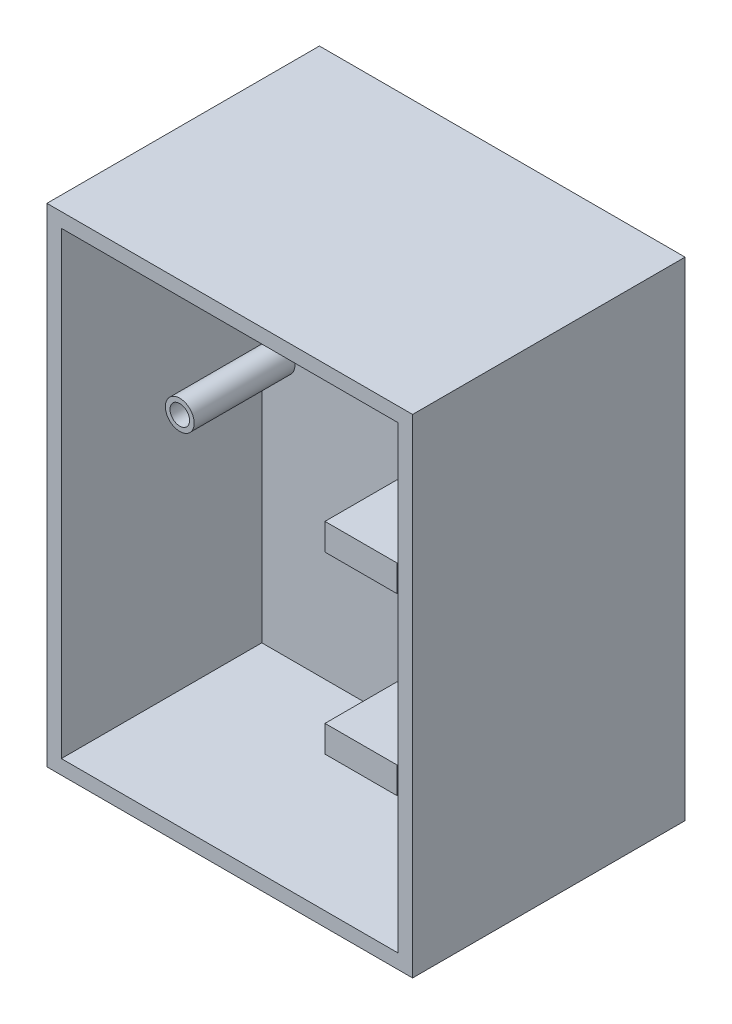
ISO-10303-21;
HEADER;
FILE_DESCRIPTION(('STEP AP214'),'2;1');
FILE_NAME('part.step','',(''),(''),'','','');
FILE_SCHEMA(('AUTOMOTIVE_DESIGN { 1 0 10303 214 1 1 1 1 }'));
ENDSEC;
DATA;
#1=APPLICATION_CONTEXT('core data for automotive mechanical design processes');
#2=APPLICATION_PROTOCOL_DEFINITION('international standard','automotive_design',2000,#1);
#3=PRODUCT_CONTEXT('',#1,'mechanical');
#4=PRODUCT('Part','Part','',(#3));
#5=PRODUCT_RELATED_PRODUCT_CATEGORY('part','',(#4));
#6=PRODUCT_DEFINITION_FORMATION('','',#4);
#7=PRODUCT_DEFINITION_CONTEXT('part definition',#1,'design');
#8=PRODUCT_DEFINITION('design','',#6,#7);
#9=PRODUCT_DEFINITION_SHAPE('','',#8);
#10=(LENGTH_UNIT() NAMED_UNIT(*) SI_UNIT(.MILLI.,.METRE.));
#11=(NAMED_UNIT(*) PLANE_ANGLE_UNIT() SI_UNIT($,.RADIAN.));
#12=(NAMED_UNIT(*) SI_UNIT($,.STERADIAN.) SOLID_ANGLE_UNIT());
#13=UNCERTAINTY_MEASURE_WITH_UNIT(LENGTH_MEASURE(1.E-05),#10,'distance_accuracy_value','');
#14=(GEOMETRIC_REPRESENTATION_CONTEXT(3) GLOBAL_UNCERTAINTY_ASSIGNED_CONTEXT((#13)) GLOBAL_UNIT_ASSIGNED_CONTEXT((#10,
#11,#12)) REPRESENTATION_CONTEXT('',''));
#15=CARTESIAN_POINT('',(0.,0.,0.));
#16=DIRECTION('',(0.,0.,1.));
#17=DIRECTION('',(1.,0.,0.));
#18=AXIS2_PLACEMENT_3D('',#15,#16,#17);
#19=CARTESIAN_POINT('',(0.,0.,0.));
#20=DIRECTION('',(0.,0.,-1.));
#21=DIRECTION('',(-1.,0.,0.));
#22=AXIS2_PLACEMENT_3D('',#19,#20,#21);
#23=PLANE('',#22);
#24=CARTESIAN_POINT('',(-26.3939522457264,35.6308833834333,0.));
#25=DIRECTION('',(0.,0.,-1.));
#26=DIRECTION('',(-1.,0.,0.));
#27=AXIS2_PLACEMENT_3D('',#24,#25,#26);
#28=CIRCLE('',#27,2.54);
#29=CARTESIAN_POINT('',(-28.9339522457264,35.6308833834333,0.));
#30=VERTEX_POINT('',#29);
#31=EDGE_CURVE('E12',#30,#30,#28,.F.);
#32=ORIENTED_EDGE('',*,*,#31,.F.);
#33=EDGE_LOOP('',(#32));
#34=FACE_BOUND('',#33,.T.);
#35=CARTESIAN_POINT('',(26.3939522457264,20.25015,0.));
#36=DIRECTION('',(0.,0.,-1.));
#37=DIRECTION('',(-1.,0.,0.));
#38=AXIS2_PLACEMENT_3D('',#35,#36,#37);
#39=CIRCLE('',#38,2.54);
#40=CARTESIAN_POINT('',(23.8539522457264,20.25015,0.));
#41=VERTEX_POINT('',#40);
#42=EDGE_CURVE('E83',#41,#41,#39,.F.);
#43=ORIENTED_EDGE('',*,*,#42,.F.);
#44=EDGE_LOOP('',(#43));
#45=FACE_BOUND('',#44,.T.);
#46=CARTESIAN_POINT('',(26.3939522457264,6.33839091862332,0.));
#47=DIRECTION('',(0.,0.,-1.));
#48=DIRECTION('',(-1.,0.,0.));
#49=AXIS2_PLACEMENT_3D('',#46,#47,#48);
#50=CIRCLE('',#49,2.54);
#51=CARTESIAN_POINT('',(23.8539522457264,6.33839091862332,0.));
#52=VERTEX_POINT('',#51);
#53=EDGE_CURVE('E364',#52,#52,#50,.F.);
#54=ORIENTED_EDGE('',*,*,#53,.F.);
#55=EDGE_LOOP('',(#54));
#56=FACE_BOUND('',#55,.T.);
#57=CARTESIAN_POINT('',(-26.3939522457264,4.86941661656667,0.));
#58=DIRECTION('',(0.,0.,-1.));
#59=DIRECTION('',(-1.,0.,0.));
#60=AXIS2_PLACEMENT_3D('',#57,#58,#59);
#61=CIRCLE('',#60,2.54);
#62=CARTESIAN_POINT('',(-28.9339522457264,4.86941661656667,0.));
#63=VERTEX_POINT('',#62);
#64=EDGE_CURVE('E361',#63,#63,#61,.F.);
#65=ORIENTED_EDGE('',*,*,#64,.F.);
#66=EDGE_LOOP('',(#65));
#67=FACE_BOUND('',#66,.T.);
#68=DIRECTION('',(0.,-1.,0.));
#69=VECTOR('',#68,1.);
#70=CARTESIAN_POINT('',(-5.86370800542826,0.,0.));
#71=LINE('',#70,#69);
#72=CARTESIAN_POINT('',(-5.86370800542823,-34.5313,0.));
#73=VERTEX_POINT('',#72);
#74=CARTESIAN_POINT('',(-5.86370800542823,-39.2237089373718,0.));
#75=VERTEX_POINT('',#74);
#76=EDGE_CURVE('E259',#73,#75,#71,.T.);
#77=ORIENTED_EDGE('',*,*,#76,.F.);
#78=DIRECTION('',(1.,0.,0.));
#79=VECTOR('',#78,1.);
#80=CARTESIAN_POINT('',(0.,-34.5313,0.));
#81=LINE('',#80,#79);
#82=CARTESIAN_POINT('',(6.83629199457176,-34.5313,0.));
#83=VERTEX_POINT('',#82);
#84=EDGE_CURVE('E243',#73,#83,#81,.T.);
#85=ORIENTED_EDGE('',*,*,#84,.T.);
#86=DIRECTION('',(0.,-1.,0.));
#87=VECTOR('',#86,1.);
#88=CARTESIAN_POINT('',(6.83629199457177,0.,0.));
#89=LINE('',#88,#87);
#90=CARTESIAN_POINT('',(6.83629199457176,-39.2237089373718,0.));
#91=VERTEX_POINT('',#90);
#92=EDGE_CURVE('E248',#83,#91,#89,.T.);
#93=ORIENTED_EDGE('',*,*,#92,.T.);
#94=DIRECTION('',(-1.,0.,0.));
#95=VECTOR('',#94,1.);
#96=CARTESIAN_POINT('',(0.,-39.2237089373718,0.));
#97=LINE('',#96,#95);
#98=EDGE_CURVE('E90',#91,#75,#97,.T.);
#99=ORIENTED_EDGE('',*,*,#98,.T.);
#100=EDGE_LOOP('',(#77,#85,#93,#99));
#101=FACE_BOUND('',#100,.T.);
#102=DIRECTION('',(1.,0.,0.));
#103=VECTOR('',#102,1.);
#104=CARTESIAN_POINT('',(-29.7053,-40.5003,0.));
#105=LINE('',#104,#103);
#106=CARTESIAN_POINT('',(-29.7053,-40.5003,0.));
#107=VERTEX_POINT('',#106);
#108=CARTESIAN_POINT('',(29.7053,-40.5003,0.));
#109=VERTEX_POINT('',#108);
#110=EDGE_CURVE('E318',#107,#109,#105,.T.);
#111=ORIENTED_EDGE('',*,*,#110,.T.);
#112=DIRECTION('',(0.,1.,0.));
#113=VECTOR('',#112,1.);
#114=CARTESIAN_POINT('',(29.7053,40.5003,0.));
#115=LINE('',#114,#113);
#116=CARTESIAN_POINT('',(29.7053,40.5003,0.));
#117=VERTEX_POINT('',#116);
#118=EDGE_CURVE('E314',#109,#117,#115,.T.);
#119=ORIENTED_EDGE('',*,*,#118,.T.);
#120=DIRECTION('',(-1.,0.,0.));
#121=VECTOR('',#120,1.);
#122=CARTESIAN_POINT('',(-29.7053,40.5003,0.));
#123=LINE('',#122,#121);
#124=CARTESIAN_POINT('',(-29.7053,40.5003,0.));
#125=VERTEX_POINT('',#124);
#126=EDGE_CURVE('E328',#117,#125,#123,.T.);
#127=ORIENTED_EDGE('',*,*,#126,.T.);
#128=DIRECTION('',(0.,-1.,0.));
#129=VECTOR('',#128,1.);
#130=CARTESIAN_POINT('',(-29.7053,40.5003,0.));
#131=LINE('',#130,#129);
#132=EDGE_CURVE('E331',#125,#107,#131,.T.);
#133=ORIENTED_EDGE('',*,*,#132,.T.);
#134=EDGE_LOOP('',(#111,#119,#127,#133));
#135=FACE_BOUND('',#134,.T.);
#136=DIRECTION('',(0.,1.,0.));
#137=VECTOR('',#136,1.);
#138=CARTESIAN_POINT('',(6.83629199457176,0.,0.));
#139=LINE('',#138,#137);
#140=CARTESIAN_POINT('',(6.83629199457176,-8.3693,0.));
#141=VERTEX_POINT('',#140);
#142=CARTESIAN_POINT('',(6.83629199457176,-3.67689106262814,0.));
#143=VERTEX_POINT('',#142);
#144=EDGE_CURVE('E272',#141,#143,#139,.T.);
#145=ORIENTED_EDGE('',*,*,#144,.F.);
#146=DIRECTION('',(1.,0.,0.));
#147=VECTOR('',#146,1.);
#148=CARTESIAN_POINT('',(0.,-8.3693,0.));
#149=LINE('',#148,#147);
#150=CARTESIAN_POINT('',(-5.86370800542824,-8.3693,0.));
#151=VERTEX_POINT('',#150);
#152=EDGE_CURVE('E277',#151,#141,#149,.T.);
#153=ORIENTED_EDGE('',*,*,#152,.F.);
#154=DIRECTION('',(0.,1.,0.));
#155=VECTOR('',#154,1.);
#156=CARTESIAN_POINT('',(-5.86370800542824,0.,0.));
#157=LINE('',#156,#155);
#158=CARTESIAN_POINT('',(-5.86370800542824,-3.67689106262814,0.));
#159=VERTEX_POINT('',#158);
#160=EDGE_CURVE('E288',#151,#159,#157,.T.);
#161=ORIENTED_EDGE('',*,*,#160,.T.);
#162=DIRECTION('',(-1.,0.,0.));
#163=VECTOR('',#162,1.);
#164=CARTESIAN_POINT('',(0.,-3.67689106262814,0.));
#165=LINE('',#164,#163);
#166=EDGE_CURVE('E98',#143,#159,#165,.T.);
#167=ORIENTED_EDGE('',*,*,#166,.F.);
#168=EDGE_LOOP('',(#145,#153,#161,#167));
#169=FACE_BOUND('',#168,.T.);
#170=ADVANCED_FACE('F75',(#34,#45,#56,#67,#101,#135,#169),#23,.F.);
#171=CARTESIAN_POINT('',(0.,0.,35.3568));
#172=DIRECTION('',(0.,0.,1.));
#173=DIRECTION('',(1.,0.,0.));
#174=AXIS2_PLACEMENT_3D('',#171,#172,#173);
#175=PLANE('',#174);
#176=DIRECTION('',(0.,1.,0.));
#177=VECTOR('',#176,1.);
#178=CARTESIAN_POINT('',(32.2453,40.5003,35.3568));
#179=LINE('',#178,#177);
#180=CARTESIAN_POINT('',(32.2453,-43.0403,35.3568));
#181=VERTEX_POINT('',#180);
#182=CARTESIAN_POINT('',(32.2453,43.0403,35.3568));
#183=VERTEX_POINT('',#182);
#184=EDGE_CURVE('E344',#181,#183,#179,.T.);
#185=ORIENTED_EDGE('',*,*,#184,.T.);
#186=DIRECTION('',(-1.,0.,0.));
#187=VECTOR('',#186,1.);
#188=CARTESIAN_POINT('',(-29.7053,43.0403,35.3568));
#189=LINE('',#188,#187);
#190=CARTESIAN_POINT('',(-32.2453,43.0403,35.3568));
#191=VERTEX_POINT('',#190);
#192=EDGE_CURVE('E347',#183,#191,#189,.T.);
#193=ORIENTED_EDGE('',*,*,#192,.T.);
#194=DIRECTION('',(0.,-1.,0.));
#195=VECTOR('',#194,1.);
#196=CARTESIAN_POINT('',(-32.2453,40.5003,35.3568));
#197=LINE('',#196,#195);
#198=CARTESIAN_POINT('',(-32.2453,-43.0403,35.3568));
#199=VERTEX_POINT('',#198);
#200=EDGE_CURVE('E349',#191,#199,#197,.T.);
#201=ORIENTED_EDGE('',*,*,#200,.T.);
#202=DIRECTION('',(1.,0.,0.));
#203=VECTOR('',#202,1.);
#204=CARTESIAN_POINT('',(-29.7053,-43.0403,35.3568));
#205=LINE('',#204,#203);
#206=EDGE_CURVE('E351',#199,#181,#205,.T.);
#207=ORIENTED_EDGE('',*,*,#206,.T.);
#208=EDGE_LOOP('',(#185,#193,#201,#207));
#209=FACE_BOUND('',#208,.T.);
#210=DIRECTION('',(-1.,0.,0.));
#211=VECTOR('',#210,1.);
#212=CARTESIAN_POINT('',(-29.7053,40.5003,35.3568));
#213=LINE('',#212,#211);
#214=CARTESIAN_POINT('',(29.7053,40.5003,35.3568));
#215=VERTEX_POINT('',#214);
#216=CARTESIAN_POINT('',(-29.7053,40.5003,35.3568));
#217=VERTEX_POINT('',#216);
#218=EDGE_CURVE('E317',#215,#217,#213,.T.);
#219=ORIENTED_EDGE('',*,*,#218,.F.);
#220=DIRECTION('',(0.,1.,0.));
#221=VECTOR('',#220,1.);
#222=CARTESIAN_POINT('',(29.7053,40.5003,35.3568));
#223=LINE('',#222,#221);
#224=CARTESIAN_POINT('',(29.7053,-40.5003,35.3568));
#225=VERTEX_POINT('',#224);
#226=EDGE_CURVE('E315',#225,#215,#223,.T.);
#227=ORIENTED_EDGE('',*,*,#226,.F.);
#228=DIRECTION('',(1.,0.,0.));
#229=VECTOR('',#228,1.);
#230=CARTESIAN_POINT('',(-29.7053,-40.5003,35.3568));
#231=LINE('',#230,#229);
#232=CARTESIAN_POINT('',(-29.7053,-40.5003,35.3568));
#233=VERTEX_POINT('',#232);
#234=EDGE_CURVE('E323',#233,#225,#231,.T.);
#235=ORIENTED_EDGE('',*,*,#234,.F.);
#236=DIRECTION('',(0.,-1.,0.));
#237=VECTOR('',#236,1.);
#238=CARTESIAN_POINT('',(-29.7053,40.5003,35.3568));
#239=LINE('',#238,#237);
#240=EDGE_CURVE('E320',#217,#233,#239,.T.);
#241=ORIENTED_EDGE('',*,*,#240,.F.);
#242=EDGE_LOOP('',(#219,#227,#235,#241));
#243=FACE_BOUND('',#242,.T.);
#244=ADVANCED_FACE('F373',(#209,#243),#175,.T.);
#245=CARTESIAN_POINT('',(32.2453,40.5003,35.3568));
#246=DIRECTION('',(-1.,0.,0.));
#247=DIRECTION('',(0.,0.,1.));
#248=AXIS2_PLACEMENT_3D('',#245,#246,#247);
#249=PLANE('',#248);
#250=DIRECTION('',(0.,0.,-1.));
#251=VECTOR('',#250,1.);
#252=CARTESIAN_POINT('',(32.2453,-43.0403,35.3568));
#253=LINE('',#252,#251);
#254=CARTESIAN_POINT('',(32.2453,-43.0403,-12.7));
#255=VERTEX_POINT('',#254);
#256=EDGE_CURVE('E353',#181,#255,#253,.T.);
#257=ORIENTED_EDGE('',*,*,#256,.T.);
#258=DIRECTION('',(0.,-1.,0.));
#259=VECTOR('',#258,1.);
#260=CARTESIAN_POINT('',(32.2453,-43.0403,-12.7));
#261=LINE('',#260,#259);
#262=CARTESIAN_POINT('',(32.2453,43.0403,-12.7));
#263=VERTEX_POINT('',#262);
#264=EDGE_CURVE('E308',#263,#255,#261,.T.);
#265=ORIENTED_EDGE('',*,*,#264,.F.);
#266=DIRECTION('',(0.,0.,-1.));
#267=VECTOR('',#266,1.);
#268=CARTESIAN_POINT('',(32.2453,43.0403,35.3568));
#269=LINE('',#268,#267);
#270=EDGE_CURVE('E359',#183,#263,#269,.T.);
#271=ORIENTED_EDGE('',*,*,#270,.F.);
#272=ORIENTED_EDGE('',*,*,#184,.F.);
#273=EDGE_LOOP('',(#257,#265,#271,#272));
#274=FACE_BOUND('',#273,.T.);
#275=ADVANCED_FACE('F77',(#274),#249,.F.);
#276=CARTESIAN_POINT('',(-29.7053,43.0403,35.3568));
#277=DIRECTION('',(0.,-1.,0.));
#278=DIRECTION('',(0.,0.,-1.));
#279=AXIS2_PLACEMENT_3D('',#276,#277,#278);
#280=PLANE('',#279);
#281=ORIENTED_EDGE('',*,*,#270,.T.);
#282=DIRECTION('',(1.,0.,0.));
#283=VECTOR('',#282,1.);
#284=CARTESIAN_POINT('',(-32.2453,43.0403,-12.7));
#285=LINE('',#284,#283);
#286=CARTESIAN_POINT('',(-32.2453,43.0403,-12.7));
#287=VERTEX_POINT('',#286);
#288=EDGE_CURVE('E305',#287,#263,#285,.T.);
#289=ORIENTED_EDGE('',*,*,#288,.F.);
#290=DIRECTION('',(0.,0.,-1.));
#291=VECTOR('',#290,1.);
#292=CARTESIAN_POINT('',(-32.2453,43.0403,35.3568));
#293=LINE('',#292,#291);
#294=EDGE_CURVE('E357',#191,#287,#293,.T.);
#295=ORIENTED_EDGE('',*,*,#294,.F.);
#296=ORIENTED_EDGE('',*,*,#192,.F.);
#297=EDGE_LOOP('',(#281,#289,#295,#296));
#298=FACE_BOUND('',#297,.T.);
#299=ADVANCED_FACE('F439',(#298),#280,.F.);
#300=CARTESIAN_POINT('',(-32.2453,40.5003,35.3568));
#301=DIRECTION('',(1.,0.,0.));
#302=DIRECTION('',(0.,1.,0.));
#303=AXIS2_PLACEMENT_3D('',#300,#301,#302);
#304=PLANE('',#303);
#305=ORIENTED_EDGE('',*,*,#294,.T.);
#306=DIRECTION('',(0.,1.,0.));
#307=VECTOR('',#306,1.);
#308=CARTESIAN_POINT('',(-32.2453,-43.0403,-12.7));
#309=LINE('',#308,#307);
#310=CARTESIAN_POINT('',(-32.2453,-43.0403,-12.7));
#311=VERTEX_POINT('',#310);
#312=EDGE_CURVE('E302',#311,#287,#309,.T.);
#313=ORIENTED_EDGE('',*,*,#312,.F.);
#314=DIRECTION('',(0.,0.,-1.));
#315=VECTOR('',#314,1.);
#316=CARTESIAN_POINT('',(-32.2453,-43.0403,35.3568));
#317=LINE('',#316,#315);
#318=EDGE_CURVE('E355',#199,#311,#317,.T.);
#319=ORIENTED_EDGE('',*,*,#318,.F.);
#320=ORIENTED_EDGE('',*,*,#200,.F.);
#321=EDGE_LOOP('',(#305,#313,#319,#320));
#322=FACE_BOUND('',#321,.T.);
#323=ADVANCED_FACE('F436',(#322),#304,.F.);
#324=CARTESIAN_POINT('',(-29.7053,-43.0403,35.3568));
#325=DIRECTION('',(0.,1.,0.));
#326=DIRECTION('',(0.,0.,1.));
#327=AXIS2_PLACEMENT_3D('',#324,#325,#326);
#328=PLANE('',#327);
#329=ORIENTED_EDGE('',*,*,#318,.T.);
#330=DIRECTION('',(-1.,0.,0.));
#331=VECTOR('',#330,1.);
#332=CARTESIAN_POINT('',(-32.2453,-43.0403,-12.7));
#333=LINE('',#332,#331);
#334=EDGE_CURVE('E311',#255,#311,#333,.T.);
#335=ORIENTED_EDGE('',*,*,#334,.F.);
#336=ORIENTED_EDGE('',*,*,#256,.F.);
#337=ORIENTED_EDGE('',*,*,#206,.F.);
#338=EDGE_LOOP('',(#329,#335,#336,#337));
#339=FACE_BOUND('',#338,.T.);
#340=ADVANCED_FACE('F429',(#339),#328,.F.);
#341=CARTESIAN_POINT('',(29.7053,40.5003,35.3568));
#342=DIRECTION('',(-1.,0.,0.));
#343=DIRECTION('',(0.,0.,1.));
#344=AXIS2_PLACEMENT_3D('',#341,#342,#343);
#345=PLANE('',#344);
#346=ORIENTED_EDGE('',*,*,#118,.F.);
#347=DIRECTION('',(0.,0.,-1.));
#348=VECTOR('',#347,1.);
#349=CARTESIAN_POINT('',(29.7053,-40.5003,35.3568));
#350=LINE('',#349,#348);
#351=EDGE_CURVE('E325',#225,#109,#350,.T.);
#352=ORIENTED_EDGE('',*,*,#351,.F.);
#353=ORIENTED_EDGE('',*,*,#226,.T.);
#354=DIRECTION('',(0.,0.,-1.));
#355=VECTOR('',#354,1.);
#356=CARTESIAN_POINT('',(29.7053,40.5003,35.3568));
#357=LINE('',#356,#355);
#358=EDGE_CURVE('E341',#215,#117,#357,.T.);
#359=ORIENTED_EDGE('',*,*,#358,.T.);
#360=EDGE_LOOP('',(#346,#352,#353,#359));
#361=FACE_BOUND('',#360,.T.);
#362=ADVANCED_FACE('F425',(#361),#345,.T.);
#363=CARTESIAN_POINT('',(-29.7053,40.5003,35.3568));
#364=DIRECTION('',(0.,-1.,0.));
#365=DIRECTION('',(0.,0.,-1.));
#366=AXIS2_PLACEMENT_3D('',#363,#364,#365);
#367=PLANE('',#366);
#368=ORIENTED_EDGE('',*,*,#126,.F.);
#369=ORIENTED_EDGE('',*,*,#358,.F.);
#370=ORIENTED_EDGE('',*,*,#218,.T.);
#371=DIRECTION('',(0.,0.,-1.));
#372=VECTOR('',#371,1.);
#373=CARTESIAN_POINT('',(-29.7053,40.5003,35.3568));
#374=LINE('',#373,#372);
#375=EDGE_CURVE('E339',#217,#125,#374,.T.);
#376=ORIENTED_EDGE('',*,*,#375,.T.);
#377=EDGE_LOOP('',(#368,#369,#370,#376));
#378=FACE_BOUND('',#377,.T.);
#379=ADVANCED_FACE('F421',(#378),#367,.T.);
#380=CARTESIAN_POINT('',(-29.7053,40.5003,35.3568));
#381=DIRECTION('',(1.,0.,0.));
#382=DIRECTION('',(0.,1.,0.));
#383=AXIS2_PLACEMENT_3D('',#380,#381,#382);
#384=PLANE('',#383);
#385=ORIENTED_EDGE('',*,*,#132,.F.);
#386=ORIENTED_EDGE('',*,*,#375,.F.);
#387=ORIENTED_EDGE('',*,*,#240,.T.);
#388=DIRECTION('',(0.,0.,-1.));
#389=VECTOR('',#388,1.);
#390=CARTESIAN_POINT('',(-29.7053,-40.5003,35.3568));
#391=LINE('',#390,#389);
#392=EDGE_CURVE('E337',#233,#107,#391,.T.);
#393=ORIENTED_EDGE('',*,*,#392,.T.);
#394=EDGE_LOOP('',(#385,#386,#387,#393));
#395=FACE_BOUND('',#394,.T.);
#396=ADVANCED_FACE('F417',(#395),#384,.T.);
#397=CARTESIAN_POINT('',(-29.7053,-40.5003,35.3568));
#398=DIRECTION('',(0.,1.,0.));
#399=DIRECTION('',(0.,0.,1.));
#400=AXIS2_PLACEMENT_3D('',#397,#398,#399);
#401=PLANE('',#400);
#402=ORIENTED_EDGE('',*,*,#110,.F.);
#403=ORIENTED_EDGE('',*,*,#392,.F.);
#404=ORIENTED_EDGE('',*,*,#234,.T.);
#405=ORIENTED_EDGE('',*,*,#351,.T.);
#406=EDGE_LOOP('',(#402,#403,#404,#405));
#407=FACE_BOUND('',#406,.T.);
#408=ADVANCED_FACE('F412',(#407),#401,.T.);
#409=CARTESIAN_POINT('',(0.,0.,-12.7));
#410=DIRECTION('',(0.,0.,-1.));
#411=DIRECTION('',(-1.,0.,0.));
#412=AXIS2_PLACEMENT_3D('',#409,#410,#411);
#413=PLANE('',#412);
#414=ORIENTED_EDGE('',*,*,#312,.T.);
#415=ORIENTED_EDGE('',*,*,#288,.T.);
#416=ORIENTED_EDGE('',*,*,#264,.T.);
#417=ORIENTED_EDGE('',*,*,#334,.T.);
#418=EDGE_LOOP('',(#414,#415,#416,#417));
#419=FACE_BOUND('',#418,.T.);
#420=ADVANCED_FACE('F407',(#419),#413,.T.);
#421=CARTESIAN_POINT('',(6.83629199457176,0.,12.7));
#422=DIRECTION('',(-1.,0.,0.));
#423=DIRECTION('',(0.,-1.,0.));
#424=AXIS2_PLACEMENT_3D('',#421,#422,#423);
#425=PLANE('',#424);
#426=ORIENTED_EDGE('',*,*,#144,.T.);
#427=DIRECTION('',(0.,0.,-1.));
#428=VECTOR('',#427,1.);
#429=CARTESIAN_POINT('',(6.83629199457176,-3.67689106262814,12.7));
#430=LINE('',#429,#428);
#431=CARTESIAN_POINT('',(6.83629199457176,-3.67689106262814,12.7));
#432=VERTEX_POINT('',#431);
#433=EDGE_CURVE('E300',#432,#143,#430,.T.);
#434=ORIENTED_EDGE('',*,*,#433,.F.);
#435=DIRECTION('',(0.,1.,0.));
#436=VECTOR('',#435,1.);
#437=CARTESIAN_POINT('',(6.83629199457176,0.,12.7));
#438=LINE('',#437,#436);
#439=CARTESIAN_POINT('',(6.83629199457176,-8.3693,12.7));
#440=VERTEX_POINT('',#439);
#441=EDGE_CURVE('E273',#440,#432,#438,.T.);
#442=ORIENTED_EDGE('',*,*,#441,.F.);
#443=DIRECTION('',(0.,0.,-1.));
#444=VECTOR('',#443,1.);
#445=CARTESIAN_POINT('',(6.83629199457176,-8.3693,12.7));
#446=LINE('',#445,#444);
#447=EDGE_CURVE('E284',#440,#141,#446,.T.);
#448=ORIENTED_EDGE('',*,*,#447,.T.);
#449=EDGE_LOOP('',(#426,#434,#442,#448));
#450=FACE_BOUND('',#449,.T.);
#451=ADVANCED_FACE('F391',(#450),#425,.F.);
#452=CARTESIAN_POINT('',(0.,-3.67689106262814,12.7));
#453=DIRECTION('',(0.,-1.,0.));
#454=DIRECTION('',(1.,0.,0.));
#455=AXIS2_PLACEMENT_3D('',#452,#453,#454);
#456=PLANE('',#455);
#457=ORIENTED_EDGE('',*,*,#166,.T.);
#458=DIRECTION('',(0.,0.,-1.));
#459=VECTOR('',#458,1.);
#460=CARTESIAN_POINT('',(-5.86370800542824,-3.67689106262814,12.7));
#461=LINE('',#460,#459);
#462=CARTESIAN_POINT('',(-5.86370800542824,-3.67689106262814,12.7));
#463=VERTEX_POINT('',#462);
#464=EDGE_CURVE('E297',#463,#159,#461,.T.);
#465=ORIENTED_EDGE('',*,*,#464,.F.);
#466=DIRECTION('',(-1.,0.,0.));
#467=VECTOR('',#466,1.);
#468=CARTESIAN_POINT('',(0.,-3.67689106262814,12.7));
#469=LINE('',#468,#467);
#470=EDGE_CURVE('E276',#432,#463,#469,.T.);
#471=ORIENTED_EDGE('',*,*,#470,.F.);
#472=ORIENTED_EDGE('',*,*,#433,.T.);
#473=EDGE_LOOP('',(#457,#465,#471,#472));
#474=FACE_BOUND('',#473,.T.);
#475=ADVANCED_FACE('F399',(#474),#456,.F.);
#476=CARTESIAN_POINT('',(-5.86370800542824,0.,12.7));
#477=DIRECTION('',(-1.,0.,0.));
#478=DIRECTION('',(0.,0.,1.));
#479=AXIS2_PLACEMENT_3D('',#476,#477,#478);
#480=PLANE('',#479);
#481=ORIENTED_EDGE('',*,*,#160,.F.);
#482=DIRECTION('',(0.,0.,-1.));
#483=VECTOR('',#482,1.);
#484=CARTESIAN_POINT('',(-5.86370800542824,-8.3693,12.7));
#485=LINE('',#484,#483);
#486=CARTESIAN_POINT('',(-5.86370800542824,-8.3693,12.7));
#487=VERTEX_POINT('',#486);
#488=EDGE_CURVE('E294',#487,#151,#485,.T.);
#489=ORIENTED_EDGE('',*,*,#488,.F.);
#490=DIRECTION('',(0.,1.,0.));
#491=VECTOR('',#490,1.);
#492=CARTESIAN_POINT('',(-5.86370800542824,0.,12.7));
#493=LINE('',#492,#491);
#494=EDGE_CURVE('E279',#487,#463,#493,.T.);
#495=ORIENTED_EDGE('',*,*,#494,.T.);
#496=ORIENTED_EDGE('',*,*,#464,.T.);
#497=EDGE_LOOP('',(#481,#489,#495,#496));
#498=FACE_BOUND('',#497,.T.);
#499=ADVANCED_FACE('F397',(#498),#480,.T.);
#500=CARTESIAN_POINT('',(0.,-8.3693,12.7));
#501=DIRECTION('',(0.,1.,0.));
#502=DIRECTION('',(0.,0.,1.));
#503=AXIS2_PLACEMENT_3D('',#500,#501,#502);
#504=PLANE('',#503);
#505=ORIENTED_EDGE('',*,*,#152,.T.);
#506=ORIENTED_EDGE('',*,*,#447,.F.);
#507=DIRECTION('',(1.,0.,0.));
#508=VECTOR('',#507,1.);
#509=CARTESIAN_POINT('',(0.,-8.3693,12.7));
#510=LINE('',#509,#508);
#511=EDGE_CURVE('E282',#487,#440,#510,.T.);
#512=ORIENTED_EDGE('',*,*,#511,.F.);
#513=ORIENTED_EDGE('',*,*,#488,.T.);
#514=EDGE_LOOP('',(#505,#506,#512,#513));
#515=FACE_BOUND('',#514,.T.);
#516=ADVANCED_FACE('F387',(#515),#504,.F.);
#517=CARTESIAN_POINT('',(0.,0.,12.7));
#518=DIRECTION('',(0.,0.,1.));
#519=DIRECTION('',(1.,0.,0.));
#520=AXIS2_PLACEMENT_3D('',#517,#518,#519);
#521=PLANE('',#520);
#522=ORIENTED_EDGE('',*,*,#441,.T.);
#523=ORIENTED_EDGE('',*,*,#470,.T.);
#524=ORIENTED_EDGE('',*,*,#494,.F.);
#525=ORIENTED_EDGE('',*,*,#511,.T.);
#526=EDGE_LOOP('',(#522,#523,#524,#525));
#527=FACE_BOUND('',#526,.T.);
#528=ADVANCED_FACE('F393',(#527),#521,.T.);
#529=CARTESIAN_POINT('',(0.,-34.5313,12.7));
#530=DIRECTION('',(0.,1.,0.));
#531=DIRECTION('',(0.,0.,1.));
#532=AXIS2_PLACEMENT_3D('',#529,#530,#531);
#533=PLANE('',#532);
#534=ORIENTED_EDGE('',*,*,#84,.F.);
#535=DIRECTION('',(0.,0.,-1.));
#536=VECTOR('',#535,1.);
#537=CARTESIAN_POINT('',(-5.86370800542823,-34.5313,12.7));
#538=LINE('',#537,#536);
#539=CARTESIAN_POINT('',(-5.86370800542823,-34.5313,12.7));
#540=VERTEX_POINT('',#539);
#541=EDGE_CURVE('E270',#540,#73,#538,.T.);
#542=ORIENTED_EDGE('',*,*,#541,.F.);
#543=DIRECTION('',(1.,0.,0.));
#544=VECTOR('',#543,1.);
#545=CARTESIAN_POINT('',(0.,-34.5313,12.7));
#546=LINE('',#545,#544);
#547=CARTESIAN_POINT('',(6.83629199457176,-34.5313,12.7));
#548=VERTEX_POINT('',#547);
#549=EDGE_CURVE('E244',#540,#548,#546,.T.);
#550=ORIENTED_EDGE('',*,*,#549,.T.);
#551=DIRECTION('',(0.,0.,-1.));
#552=VECTOR('',#551,1.);
#553=CARTESIAN_POINT('',(6.83629199457176,-34.5313,12.7));
#554=LINE('',#553,#552);
#555=EDGE_CURVE('E256',#548,#83,#554,.T.);
#556=ORIENTED_EDGE('',*,*,#555,.T.);
#557=EDGE_LOOP('',(#534,#542,#550,#556));
#558=FACE_BOUND('',#557,.T.);
#559=ADVANCED_FACE('F677',(#558),#533,.T.);
#560=CARTESIAN_POINT('',(-5.86370800542826,0.,12.7));
#561=DIRECTION('',(1.,0.,0.));
#562=DIRECTION('',(0.,1.,0.));
#563=AXIS2_PLACEMENT_3D('',#560,#561,#562);
#564=PLANE('',#563);
#565=ORIENTED_EDGE('',*,*,#76,.T.);
#566=DIRECTION('',(0.,0.,-1.));
#567=VECTOR('',#566,1.);
#568=CARTESIAN_POINT('',(-5.86370800542823,-39.2237089373718,12.7));
#569=LINE('',#568,#567);
#570=CARTESIAN_POINT('',(-5.86370800542823,-39.2237089373718,12.7));
#571=VERTEX_POINT('',#570);
#572=EDGE_CURVE('E268',#571,#75,#569,.T.);
#573=ORIENTED_EDGE('',*,*,#572,.F.);
#574=DIRECTION('',(0.,-1.,0.));
#575=VECTOR('',#574,1.);
#576=CARTESIAN_POINT('',(-5.86370800542826,0.,12.7));
#577=LINE('',#576,#575);
#578=EDGE_CURVE('E247',#540,#571,#577,.T.);
#579=ORIENTED_EDGE('',*,*,#578,.F.);
#580=ORIENTED_EDGE('',*,*,#541,.T.);
#581=EDGE_LOOP('',(#565,#573,#579,#580));
#582=FACE_BOUND('',#581,.T.);
#583=ADVANCED_FACE('F674',(#582),#564,.F.);
#584=CARTESIAN_POINT('',(0.,-39.2237089373718,12.7));
#585=DIRECTION('',(0.,-1.,0.));
#586=DIRECTION('',(0.,0.,-1.));
#587=AXIS2_PLACEMENT_3D('',#584,#585,#586);
#588=PLANE('',#587);
#589=ORIENTED_EDGE('',*,*,#98,.F.);
#590=DIRECTION('',(0.,0.,-1.));
#591=VECTOR('',#590,1.);
#592=CARTESIAN_POINT('',(6.83629199457176,-39.2237089373718,12.7));
#593=LINE('',#592,#591);
#594=CARTESIAN_POINT('',(6.83629199457176,-39.2237089373718,12.7));
#595=VERTEX_POINT('',#594);
#596=EDGE_CURVE('E266',#595,#91,#593,.T.);
#597=ORIENTED_EDGE('',*,*,#596,.F.);
#598=DIRECTION('',(-1.,0.,0.));
#599=VECTOR('',#598,1.);
#600=CARTESIAN_POINT('',(0.,-39.2237089373718,12.7));
#601=LINE('',#600,#599);
#602=EDGE_CURVE('E250',#595,#571,#601,.T.);
#603=ORIENTED_EDGE('',*,*,#602,.T.);
#604=ORIENTED_EDGE('',*,*,#572,.T.);
#605=EDGE_LOOP('',(#589,#597,#603,#604));
#606=FACE_BOUND('',#605,.T.);
#607=ADVANCED_FACE('F670',(#606),#588,.T.);
#608=CARTESIAN_POINT('',(6.83629199457177,0.,12.7));
#609=DIRECTION('',(1.,0.,0.));
#610=DIRECTION('',(0.,1.,0.));
#611=AXIS2_PLACEMENT_3D('',#608,#609,#610);
#612=PLANE('',#611);
#613=ORIENTED_EDGE('',*,*,#92,.F.);
#614=ORIENTED_EDGE('',*,*,#555,.F.);
#615=DIRECTION('',(0.,-1.,0.));
#616=VECTOR('',#615,1.);
#617=CARTESIAN_POINT('',(6.83629199457177,0.,12.7));
#618=LINE('',#617,#616);
#619=EDGE_CURVE('E253',#548,#595,#618,.T.);
#620=ORIENTED_EDGE('',*,*,#619,.T.);
#621=ORIENTED_EDGE('',*,*,#596,.T.);
#622=EDGE_LOOP('',(#613,#614,#620,#621));
#623=FACE_BOUND('',#622,.T.);
#624=ADVANCED_FACE('F666',(#623),#612,.T.);
#625=CARTESIAN_POINT('',(0.,0.,12.7));
#626=DIRECTION('',(0.,0.,1.));
#627=DIRECTION('',(1.,0.,0.));
#628=AXIS2_PLACEMENT_3D('',#625,#626,#627);
#629=PLANE('',#628);
#630=ORIENTED_EDGE('',*,*,#549,.F.);
#631=ORIENTED_EDGE('',*,*,#578,.T.);
#632=ORIENTED_EDGE('',*,*,#602,.F.);
#633=ORIENTED_EDGE('',*,*,#619,.F.);
#634=EDGE_LOOP('',(#630,#631,#632,#633));
#635=FACE_BOUND('',#634,.T.);
#636=ADVANCED_FACE('F486',(#635),#629,.T.);
#637=CARTESIAN_POINT('',(-26.3939522457264,4.86941661656667,17.78));
#638=DIRECTION('',(0.,0.,-1.));
#639=DIRECTION('',(-1.,0.,0.));
#640=AXIS2_PLACEMENT_3D('',#637,#638,#639);
#641=CYLINDRICAL_SURFACE('',#640,2.54);
#642=CARTESIAN_POINT('',(-26.3939522457264,4.86941661656667,17.78));
#643=DIRECTION('',(0.,0.,1.));
#644=DIRECTION('',(1.,0.,0.));
#645=AXIS2_PLACEMENT_3D('',#642,#643,#644);
#646=CIRCLE('',#645,2.54);
#647=CARTESIAN_POINT('',(-23.8539522457264,4.86941661656667,17.78));
#648=VERTEX_POINT('',#647);
#649=EDGE_CURVE('E240',#648,#648,#646,.T.);
#650=ORIENTED_EDGE('',*,*,#649,.F.);
#651=EDGE_LOOP('',(#650));
#652=FACE_BOUND('',#651,.T.);
#653=ORIENTED_EDGE('',*,*,#64,.T.);
#654=EDGE_LOOP('',(#653));
#655=FACE_BOUND('',#654,.T.);
#656=ADVANCED_FACE('F491',(#652,#655),#641,.T.);
#657=CARTESIAN_POINT('',(0.,0.,17.78));
#658=DIRECTION('',(0.,0.,1.));
#659=DIRECTION('',(1.,0.,0.));
#660=AXIS2_PLACEMENT_3D('',#657,#658,#659);
#661=PLANE('',#660);
#662=CARTESIAN_POINT('',(-26.3939522457264,4.86941661656667,17.78));
#663=DIRECTION('',(0.,0.,1.));
#664=DIRECTION('',(1.,0.,0.));
#665=AXIS2_PLACEMENT_3D('',#662,#663,#664);
#666=CIRCLE('',#665,1.72719999999999);
#667=CARTESIAN_POINT('',(-24.6667522457264,4.86941661656667,17.78));
#668=VERTEX_POINT('',#667);
#669=EDGE_CURVE('E209',#668,#668,#666,.T.);
#670=ORIENTED_EDGE('',*,*,#669,.F.);
#671=EDGE_LOOP('',(#670));
#672=FACE_BOUND('',#671,.T.);
#673=ORIENTED_EDGE('',*,*,#649,.T.);
#674=EDGE_LOOP('',(#673));
#675=FACE_BOUND('',#674,.T.);
#676=ADVANCED_FACE('F496',(#672,#675),#661,.T.);
#677=CARTESIAN_POINT('',(26.3939522457264,6.33839091862332,17.78));
#678=DIRECTION('',(0.,0.,-1.));
#679=DIRECTION('',(-1.,0.,0.));
#680=AXIS2_PLACEMENT_3D('',#677,#678,#679);
#681=CYLINDRICAL_SURFACE('',#680,2.54);
#682=CARTESIAN_POINT('',(26.3939522457264,6.33839091862332,17.78));
#683=DIRECTION('',(0.,0.,1.));
#684=DIRECTION('',(1.,0.,0.));
#685=AXIS2_PLACEMENT_3D('',#682,#683,#684);
#686=CIRCLE('',#685,2.54);
#687=CARTESIAN_POINT('',(28.9339522457264,6.33839091862332,17.78));
#688=VERTEX_POINT('',#687);
#689=EDGE_CURVE('E237',#688,#688,#686,.T.);
#690=ORIENTED_EDGE('',*,*,#689,.F.);
#691=EDGE_LOOP('',(#690));
#692=FACE_BOUND('',#691,.T.);
#693=ORIENTED_EDGE('',*,*,#53,.T.);
#694=EDGE_LOOP('',(#693));
#695=FACE_BOUND('',#694,.T.);
#696=ADVANCED_FACE('F504',(#692,#695),#681,.T.);
#697=CARTESIAN_POINT('',(0.,0.,17.78));
#698=DIRECTION('',(0.,0.,1.));
#699=DIRECTION('',(1.,0.,0.));
#700=AXIS2_PLACEMENT_3D('',#697,#698,#699);
#701=PLANE('',#700);
#702=CARTESIAN_POINT('',(26.3939522457264,6.33839091862332,17.78));
#703=DIRECTION('',(0.,0.,1.));
#704=DIRECTION('',(1.,0.,0.));
#705=AXIS2_PLACEMENT_3D('',#702,#703,#704);
#706=CIRCLE('',#705,1.72719999999999);
#707=CARTESIAN_POINT('',(28.1211522457264,6.33839091862332,17.78));
#708=VERTEX_POINT('',#707);
#709=EDGE_CURVE('E225',#708,#708,#706,.T.);
#710=ORIENTED_EDGE('',*,*,#709,.F.);
#711=EDGE_LOOP('',(#710));
#712=FACE_BOUND('',#711,.T.);
#713=ORIENTED_EDGE('',*,*,#689,.T.);
#714=EDGE_LOOP('',(#713));
#715=FACE_BOUND('',#714,.T.);
#716=ADVANCED_FACE('F509',(#712,#715),#701,.T.);
#717=CARTESIAN_POINT('',(26.3939522457264,20.25015,17.78));
#718=DIRECTION('',(0.,0.,-1.));
#719=DIRECTION('',(-1.,0.,0.));
#720=AXIS2_PLACEMENT_3D('',#717,#718,#719);
#721=CYLINDRICAL_SURFACE('',#720,2.54);
#722=CARTESIAN_POINT('',(26.3939522457264,20.25015,17.78));
#723=DIRECTION('',(0.,0.,1.));
#724=DIRECTION('',(1.,0.,0.));
#725=AXIS2_PLACEMENT_3D('',#722,#723,#724);
#726=CIRCLE('',#725,2.54);
#727=CARTESIAN_POINT('',(28.9339522457264,20.25015,17.78));
#728=VERTEX_POINT('',#727);
#729=EDGE_CURVE('E234',#728,#728,#726,.T.);
#730=ORIENTED_EDGE('',*,*,#729,.F.);
#731=EDGE_LOOP('',(#730));
#732=FACE_BOUND('',#731,.T.);
#733=ORIENTED_EDGE('',*,*,#42,.T.);
#734=EDGE_LOOP('',(#733));
#735=FACE_BOUND('',#734,.T.);
#736=ADVANCED_FACE('F369',(#732,#735),#721,.T.);
#737=CARTESIAN_POINT('',(0.,0.,17.78));
#738=DIRECTION('',(0.,0.,1.));
#739=DIRECTION('',(1.,0.,0.));
#740=AXIS2_PLACEMENT_3D('',#737,#738,#739);
#741=PLANE('',#740);
#742=CARTESIAN_POINT('',(26.3939522457264,20.25015,17.78));
#743=DIRECTION('',(0.,0.,1.));
#744=DIRECTION('',(1.,0.,0.));
#745=AXIS2_PLACEMENT_3D('',#742,#743,#744);
#746=CIRCLE('',#745,1.72719999999999);
#747=CARTESIAN_POINT('',(28.1211522457264,20.25015,17.78));
#748=VERTEX_POINT('',#747);
#749=EDGE_CURVE('E219',#748,#748,#746,.T.);
#750=ORIENTED_EDGE('',*,*,#749,.F.);
#751=EDGE_LOOP('',(#750));
#752=FACE_BOUND('',#751,.T.);
#753=ORIENTED_EDGE('',*,*,#729,.T.);
#754=EDGE_LOOP('',(#753));
#755=FACE_BOUND('',#754,.T.);
#756=ADVANCED_FACE('F522',(#752,#755),#741,.T.);
#757=CARTESIAN_POINT('',(-26.3939522457264,35.6308833834333,17.78));
#758=DIRECTION('',(0.,0.,-1.));
#759=DIRECTION('',(-1.,0.,0.));
#760=AXIS2_PLACEMENT_3D('',#757,#758,#759);
#761=CYLINDRICAL_SURFACE('',#760,2.54);
#762=ORIENTED_EDGE('',*,*,#31,.T.);
#763=EDGE_LOOP('',(#762));
#764=FACE_BOUND('',#763,.T.);
#765=CARTESIAN_POINT('',(-26.3939522457264,35.6308833834333,17.78));
#766=DIRECTION('',(0.,0.,1.));
#767=DIRECTION('',(1.,0.,0.));
#768=AXIS2_PLACEMENT_3D('',#765,#766,#767);
#769=CIRCLE('',#768,2.54);
#770=CARTESIAN_POINT('',(-23.8539522457264,35.6308833834333,17.78));
#771=VERTEX_POINT('',#770);
#772=EDGE_CURVE('E231',#771,#771,#769,.T.);
#773=ORIENTED_EDGE('',*,*,#772,.F.);
#774=EDGE_LOOP('',(#773));
#775=FACE_BOUND('',#774,.T.);
#776=ADVANCED_FACE('F531',(#764,#775),#761,.T.);
#777=CARTESIAN_POINT('',(0.,0.,17.78));
#778=DIRECTION('',(0.,0.,1.));
#779=DIRECTION('',(1.,0.,0.));
#780=AXIS2_PLACEMENT_3D('',#777,#778,#779);
#781=PLANE('',#780);
#782=CARTESIAN_POINT('',(-26.3939522457264,35.6308833834333,17.78));
#783=DIRECTION('',(0.,0.,1.));
#784=DIRECTION('',(1.,0.,0.));
#785=AXIS2_PLACEMENT_3D('',#782,#783,#784);
#786=CIRCLE('',#785,1.72719999999999);
#787=CARTESIAN_POINT('',(-24.6667522457264,35.6308833834333,17.78));
#788=VERTEX_POINT('',#787);
#789=EDGE_CURVE('E208',#788,#788,#786,.T.);
#790=ORIENTED_EDGE('',*,*,#789,.F.);
#791=EDGE_LOOP('',(#790));
#792=FACE_BOUND('',#791,.T.);
#793=ORIENTED_EDGE('',*,*,#772,.T.);
#794=EDGE_LOOP('',(#793));
#795=FACE_BOUND('',#794,.T.);
#796=ADVANCED_FACE('F536',(#792,#795),#781,.T.);
#797=CARTESIAN_POINT('',(26.3939522457264,6.33839091862332,-1.01600000000001));
#798=DIRECTION('',(0.,0.,1.));
#799=DIRECTION('',(1.,0.,0.));
#800=AXIS2_PLACEMENT_3D('',#797,#798,#799);
#801=CONICAL_SURFACE('',#800,1.72719999999999,1.02974425867665);
#802=CARTESIAN_POINT('',(26.3939522457264,6.33839091862332,-2.05380646118441));
#803=VERTEX_POINT('',#802);
#804=VERTEX_LOOP('',#803);
#805=FACE_BOUND('',#804,.T.);
#806=CARTESIAN_POINT('',(26.3939522457264,6.33839091862332,-1.01600000000001));
#807=DIRECTION('',(0.,0.,1.));
#808=DIRECTION('',(1.,0.,0.));
#809=AXIS2_PLACEMENT_3D('',#806,#807,#808);
#810=CIRCLE('',#809,1.72719999999999);
#811=CARTESIAN_POINT('',(28.1211522457264,6.33839091862332,-1.01600000000001));
#812=VERTEX_POINT('',#811);
#813=EDGE_CURVE('E228',#812,#812,#810,.T.);
#814=ORIENTED_EDGE('',*,*,#813,.T.);
#815=EDGE_LOOP('',(#814));
#816=FACE_BOUND('',#815,.T.);
#817=ADVANCED_FACE('F570',(#805,#816),#801,.F.);
#818=CARTESIAN_POINT('',(26.3939522457264,6.33839091862332,17.78));
#819=DIRECTION('',(0.,0.,1.));
#820=DIRECTION('',(1.,0.,0.));
#821=AXIS2_PLACEMENT_3D('',#818,#819,#820);
#822=CYLINDRICAL_SURFACE('',#821,1.72719999999999);
#823=ORIENTED_EDGE('',*,*,#813,.F.);
#824=EDGE_LOOP('',(#823));
#825=FACE_BOUND('',#824,.T.);
#826=ORIENTED_EDGE('',*,*,#709,.T.);
#827=EDGE_LOOP('',(#826));
#828=FACE_BOUND('',#827,.T.);
#829=ADVANCED_FACE('F580',(#825,#828),#822,.F.);
#830=CARTESIAN_POINT('',(26.3939522457264,20.25015,-1.01600000000001));
#831=DIRECTION('',(0.,0.,1.));
#832=DIRECTION('',(1.,0.,0.));
#833=AXIS2_PLACEMENT_3D('',#830,#831,#832);
#834=CONICAL_SURFACE('',#833,1.72719999999999,1.02974425867665);
#835=CARTESIAN_POINT('',(26.3939522457264,20.25015,-2.05380646118441));
#836=VERTEX_POINT('',#835);
#837=VERTEX_LOOP('',#836);
#838=FACE_BOUND('',#837,.T.);
#839=CARTESIAN_POINT('',(26.3939522457264,20.25015,-1.01600000000001));
#840=DIRECTION('',(0.,0.,1.));
#841=DIRECTION('',(1.,0.,0.));
#842=AXIS2_PLACEMENT_3D('',#839,#840,#841);
#843=CIRCLE('',#842,1.72719999999999);
#844=CARTESIAN_POINT('',(28.1211522457264,20.25015,-1.01600000000001));
#845=VERTEX_POINT('',#844);
#846=EDGE_CURVE('E222',#845,#845,#843,.T.);
#847=ORIENTED_EDGE('',*,*,#846,.T.);
#848=EDGE_LOOP('',(#847));
#849=FACE_BOUND('',#848,.T.);
#850=ADVANCED_FACE('F591',(#838,#849),#834,.F.);
#851=CARTESIAN_POINT('',(26.3939522457264,20.25015,17.78));
#852=DIRECTION('',(0.,0.,1.));
#853=DIRECTION('',(1.,0.,0.));
#854=AXIS2_PLACEMENT_3D('',#851,#852,#853);
#855=CYLINDRICAL_SURFACE('',#854,1.72719999999999);
#856=ORIENTED_EDGE('',*,*,#846,.F.);
#857=EDGE_LOOP('',(#856));
#858=FACE_BOUND('',#857,.T.);
#859=ORIENTED_EDGE('',*,*,#749,.T.);
#860=EDGE_LOOP('',(#859));
#861=FACE_BOUND('',#860,.T.);
#862=ADVANCED_FACE('F603',(#858,#861),#855,.F.);
#863=CARTESIAN_POINT('',(-26.3939522457264,35.6308833834333,-1.01600000000001));
#864=DIRECTION('',(0.,0.,1.));
#865=DIRECTION('',(1.,0.,0.));
#866=AXIS2_PLACEMENT_3D('',#863,#864,#865);
#867=CONICAL_SURFACE('',#866,1.72719999999999,1.02974425867665);
#868=CARTESIAN_POINT('',(-26.3939522457264,35.6308833834333,-2.05380646118441));
#869=VERTEX_POINT('',#868);
#870=VERTEX_LOOP('',#869);
#871=FACE_BOUND('',#870,.T.);
#872=CARTESIAN_POINT('',(-26.3939522457264,35.6308833834333,-1.01600000000001));
#873=DIRECTION('',(0.,0.,1.));
#874=DIRECTION('',(1.,0.,0.));
#875=AXIS2_PLACEMENT_3D('',#872,#873,#874);
#876=CIRCLE('',#875,1.72719999999999);
#877=CARTESIAN_POINT('',(-24.6667522457264,35.6308833834333,-1.01600000000001));
#878=VERTEX_POINT('',#877);
#879=EDGE_CURVE('E212',#878,#878,#876,.T.);
#880=ORIENTED_EDGE('',*,*,#879,.T.);
#881=EDGE_LOOP('',(#880));
#882=FACE_BOUND('',#881,.T.);
#883=ADVANCED_FACE('F613',(#871,#882),#867,.F.);
#884=CARTESIAN_POINT('',(-26.3939522457264,35.6308833834333,17.78));
#885=DIRECTION('',(0.,0.,1.));
#886=DIRECTION('',(1.,0.,0.));
#887=AXIS2_PLACEMENT_3D('',#884,#885,#886);
#888=CYLINDRICAL_SURFACE('',#887,1.72719999999999);
#889=ORIENTED_EDGE('',*,*,#879,.F.);
#890=EDGE_LOOP('',(#889));
#891=FACE_BOUND('',#890,.T.);
#892=ORIENTED_EDGE('',*,*,#789,.T.);
#893=EDGE_LOOP('',(#892));
#894=FACE_BOUND('',#893,.T.);
#895=ADVANCED_FACE('F202',(#891,#894),#888,.F.);
#896=CARTESIAN_POINT('',(-26.3939522457264,4.86941661656667,-1.01600000000001));
#897=DIRECTION('',(0.,0.,1.));
#898=DIRECTION('',(1.,0.,0.));
#899=AXIS2_PLACEMENT_3D('',#896,#897,#898);
#900=CONICAL_SURFACE('',#899,1.72719999999999,1.02974425867665);
#901=CARTESIAN_POINT('',(-26.3939522457264,4.86941661656667,-2.05380646118441));
#902=VERTEX_POINT('',#901);
#903=VERTEX_LOOP('',#902);
#904=FACE_BOUND('',#903,.T.);
#905=CARTESIAN_POINT('',(-26.3939522457264,4.86941661656667,-1.01600000000001));
#906=DIRECTION('',(0.,0.,1.));
#907=DIRECTION('',(1.,0.,0.));
#908=AXIS2_PLACEMENT_3D('',#905,#906,#907);
#909=CIRCLE('',#908,1.72719999999999);
#910=CARTESIAN_POINT('',(-24.6667522457264,4.86941661656667,-1.01600000000001));
#911=VERTEX_POINT('',#910);
#912=EDGE_CURVE('E206',#911,#911,#909,.T.);
#913=ORIENTED_EDGE('',*,*,#912,.T.);
#914=EDGE_LOOP('',(#913));
#915=FACE_BOUND('',#914,.T.);
#916=ADVANCED_FACE('F198',(#904,#915),#900,.F.);
#917=CARTESIAN_POINT('',(-26.3939522457264,4.86941661656667,17.78));
#918=DIRECTION('',(0.,0.,1.));
#919=DIRECTION('',(1.,0.,0.));
#920=AXIS2_PLACEMENT_3D('',#917,#918,#919);
#921=CYLINDRICAL_SURFACE('',#920,1.72719999999999);
#922=ORIENTED_EDGE('',*,*,#912,.F.);
#923=EDGE_LOOP('',(#922));
#924=FACE_BOUND('',#923,.T.);
#925=ORIENTED_EDGE('',*,*,#669,.T.);
#926=EDGE_LOOP('',(#925));
#927=FACE_BOUND('',#926,.T.);
#928=ADVANCED_FACE('F201',(#924,#927),#921,.F.);
#929=CLOSED_SHELL('',(#170,#244,#275,#299,#323,#340,#362,#379,#396,#408,#420,#451,#475,#499,
#516,#528,#559,#583,#607,#624,#636,#656,#676,#696,#716,#736,#756,#776,#796,#817,#829,#850,#862,
#883,#895,#916,#928));
#930=MANIFOLD_SOLID_BREP('B2',#929);
#931=ADVANCED_BREP_SHAPE_REPRESENTATION('',(#18,#930),#14);
#932=SHAPE_DEFINITION_REPRESENTATION(#9,#931);
ENDSEC;
END-ISO-10303-21;
